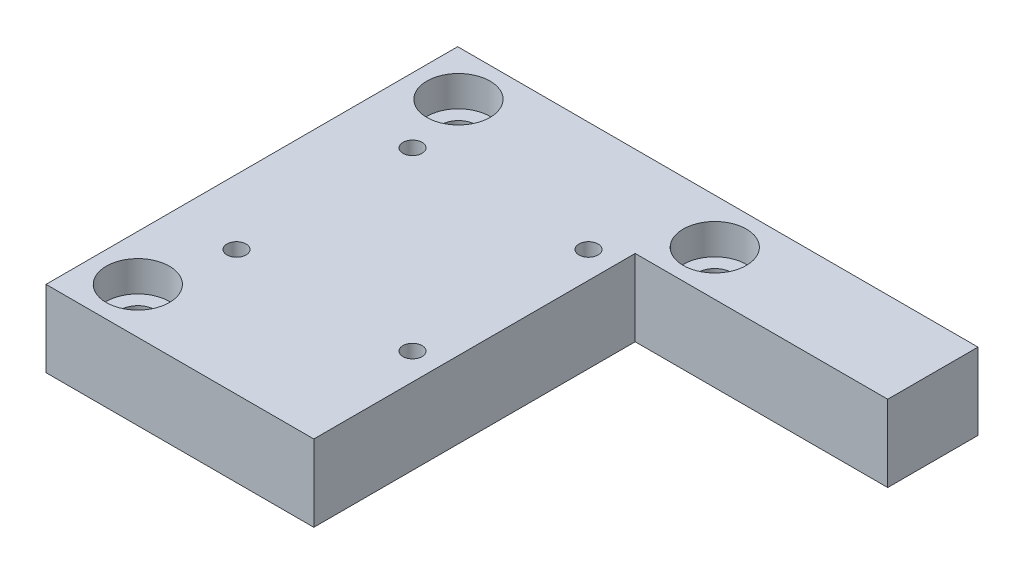
ISO-10303-21;
HEADER;
FILE_DESCRIPTION(('STEP AP214'),'2;1');
FILE_NAME('part.step','',(''),(''),'','','');
FILE_SCHEMA(('AUTOMOTIVE_DESIGN { 1 0 10303 214 1 1 1 1 }'));
ENDSEC;
DATA;
#1=APPLICATION_CONTEXT('core data for automotive mechanical design processes');
#2=APPLICATION_PROTOCOL_DEFINITION('international standard','automotive_design',2000,#1);
#3=PRODUCT_CONTEXT('',#1,'mechanical');
#4=PRODUCT('Part','Part','',(#3));
#5=PRODUCT_RELATED_PRODUCT_CATEGORY('part','',(#4));
#6=PRODUCT_DEFINITION_FORMATION('','',#4);
#7=PRODUCT_DEFINITION_CONTEXT('part definition',#1,'design');
#8=PRODUCT_DEFINITION('design','',#6,#7);
#9=PRODUCT_DEFINITION_SHAPE('','',#8);
#10=(LENGTH_UNIT() NAMED_UNIT(*) SI_UNIT(.MILLI.,.METRE.));
#11=(NAMED_UNIT(*) PLANE_ANGLE_UNIT() SI_UNIT($,.RADIAN.));
#12=(NAMED_UNIT(*) SI_UNIT($,.STERADIAN.) SOLID_ANGLE_UNIT());
#13=UNCERTAINTY_MEASURE_WITH_UNIT(LENGTH_MEASURE(1.E-05),#10,'distance_accuracy_value','');
#14=(GEOMETRIC_REPRESENTATION_CONTEXT(3) GLOBAL_UNCERTAINTY_ASSIGNED_CONTEXT((#13)) GLOBAL_UNIT_ASSIGNED_CONTEXT((#10,
#11,#12)) REPRESENTATION_CONTEXT('',''));
#15=CARTESIAN_POINT('',(0.,0.,0.));
#16=DIRECTION('',(0.,0.,1.));
#17=DIRECTION('',(1.,0.,0.));
#18=AXIS2_PLACEMENT_3D('',#15,#16,#17);
#19=CARTESIAN_POINT('',(68.,-10.,0.));
#20=DIRECTION('',(0.,0.,-1.));
#21=DIRECTION('',(-1.,0.,0.));
#22=AXIS2_PLACEMENT_3D('',#19,#20,#21);
#23=PLANE('',#22);
#24=DIRECTION('',(-1.,0.,0.));
#25=VECTOR('',#24,1.);
#26=CARTESIAN_POINT('',(68.,0.,0.));
#27=LINE('',#26,#25);
#28=CARTESIAN_POINT('',(68.,0.,0.));
#29=VERTEX_POINT('',#28);
#30=CARTESIAN_POINT('',(0.,0.,0.));
#31=VERTEX_POINT('',#30);
#32=EDGE_CURVE('E119',#29,#31,#27,.T.);
#33=ORIENTED_EDGE('',*,*,#32,.F.);
#34=DIRECTION('',(0.,1.,0.));
#35=VECTOR('',#34,1.);
#36=CARTESIAN_POINT('',(68.,-10.,0.));
#37=LINE('',#36,#35);
#38=CARTESIAN_POINT('',(68.,-10.,0.));
#39=VERTEX_POINT('',#38);
#40=EDGE_CURVE('E11',#39,#29,#37,.T.);
#41=ORIENTED_EDGE('',*,*,#40,.F.);
#42=DIRECTION('',(-1.,0.,0.));
#43=VECTOR('',#42,1.);
#44=CARTESIAN_POINT('',(68.,-10.,0.));
#45=LINE('',#44,#43);
#46=CARTESIAN_POINT('',(0.,-10.,0.));
#47=VERTEX_POINT('',#46);
#48=EDGE_CURVE('E117',#39,#47,#45,.T.);
#49=ORIENTED_EDGE('',*,*,#48,.T.);
#50=DIRECTION('',(0.,1.,0.));
#51=VECTOR('',#50,1.);
#52=CARTESIAN_POINT('',(0.,-10.,0.));
#53=LINE('',#52,#51);
#54=EDGE_CURVE('E36',#47,#31,#53,.T.);
#55=ORIENTED_EDGE('',*,*,#54,.T.);
#56=EDGE_LOOP('',(#33,#41,#49,#55));
#57=FACE_BOUND('',#56,.T.);
#58=ADVANCED_FACE('F33',(#57),#23,.T.);
#59=CARTESIAN_POINT('',(68.,-10.,53.8));
#60=DIRECTION('',(1.,0.,0.));
#61=DIRECTION('',(0.,0.,-1.));
#62=AXIS2_PLACEMENT_3D('',#59,#60,#61);
#63=PLANE('',#62);
#64=DIRECTION('',(0.,-1.,0.));
#65=VECTOR('',#64,1.);
#66=CARTESIAN_POINT('',(68.,0.,11.8));
#67=LINE('',#66,#65);
#68=CARTESIAN_POINT('',(68.,0.,11.8));
#69=VERTEX_POINT('',#68);
#70=CARTESIAN_POINT('',(68.,-10.,11.8));
#71=VERTEX_POINT('',#70);
#72=EDGE_CURVE('E129',#69,#71,#67,.T.);
#73=ORIENTED_EDGE('',*,*,#72,.T.);
#74=DIRECTION('',(0.,0.,-1.));
#75=VECTOR('',#74,1.);
#76=CARTESIAN_POINT('',(68.,-10.,53.8));
#77=LINE('',#76,#75);
#78=EDGE_CURVE('E57',#71,#39,#77,.T.);
#79=ORIENTED_EDGE('',*,*,#78,.T.);
#80=ORIENTED_EDGE('',*,*,#40,.T.);
#81=DIRECTION('',(0.,0.,-1.));
#82=VECTOR('',#81,1.);
#83=CARTESIAN_POINT('',(68.,0.,53.8));
#84=LINE('',#83,#82);
#85=EDGE_CURVE('E75',#69,#29,#84,.T.);
#86=ORIENTED_EDGE('',*,*,#85,.F.);
#87=EDGE_LOOP('',(#73,#79,#80,#86));
#88=FACE_BOUND('',#87,.T.);
#89=ADVANCED_FACE('F139',(#88),#63,.T.);
#90=CARTESIAN_POINT('',(0.,-10.,53.8));
#91=DIRECTION('',(0.,0.,1.));
#92=DIRECTION('',(1.,0.,0.));
#93=AXIS2_PLACEMENT_3D('',#90,#91,#92);
#94=PLANE('',#93);
#95=DIRECTION('',(0.,-1.,0.));
#96=VECTOR('',#95,1.);
#97=CARTESIAN_POINT('',(35.,0.,53.8));
#98=LINE('',#97,#96);
#99=CARTESIAN_POINT('',(35.,0.,53.8));
#100=VERTEX_POINT('',#99);
#101=CARTESIAN_POINT('',(35.,-10.,53.8));
#102=VERTEX_POINT('',#101);
#103=EDGE_CURVE('E99',#100,#102,#98,.T.);
#104=ORIENTED_EDGE('',*,*,#103,.F.);
#105=DIRECTION('',(1.,0.,0.));
#106=VECTOR('',#105,1.);
#107=CARTESIAN_POINT('',(0.,0.,53.8));
#108=LINE('',#107,#106);
#109=CARTESIAN_POINT('',(0.,0.,53.8));
#110=VERTEX_POINT('',#109);
#111=EDGE_CURVE('E109',#110,#100,#108,.T.);
#112=ORIENTED_EDGE('',*,*,#111,.F.);
#113=DIRECTION('',(0.,1.,0.));
#114=VECTOR('',#113,1.);
#115=CARTESIAN_POINT('',(0.,-10.,53.8));
#116=LINE('',#115,#114);
#117=CARTESIAN_POINT('',(0.,-10.,53.8));
#118=VERTEX_POINT('',#117);
#119=EDGE_CURVE('E41',#118,#110,#116,.T.);
#120=ORIENTED_EDGE('',*,*,#119,.F.);
#121=DIRECTION('',(1.,0.,0.));
#122=VECTOR('',#121,1.);
#123=CARTESIAN_POINT('',(0.,-10.,53.8));
#124=LINE('',#123,#122);
#125=EDGE_CURVE('E112',#118,#102,#124,.T.);
#126=ORIENTED_EDGE('',*,*,#125,.T.);
#127=EDGE_LOOP('',(#104,#112,#120,#126));
#128=FACE_BOUND('',#127,.T.);
#129=ADVANCED_FACE('F108',(#128),#94,.T.);
#130=CARTESIAN_POINT('',(0.,-10.,0.));
#131=DIRECTION('',(-1.,0.,0.));
#132=DIRECTION('',(0.,0.,1.));
#133=AXIS2_PLACEMENT_3D('',#130,#131,#132);
#134=PLANE('',#133);
#135=DIRECTION('',(0.,0.,1.));
#136=VECTOR('',#135,1.);
#137=CARTESIAN_POINT('',(0.,0.,0.));
#138=LINE('',#137,#136);
#139=EDGE_CURVE('E115',#31,#110,#138,.T.);
#140=ORIENTED_EDGE('',*,*,#139,.F.);
#141=ORIENTED_EDGE('',*,*,#54,.F.);
#142=DIRECTION('',(0.,0.,1.));
#143=VECTOR('',#142,1.);
#144=CARTESIAN_POINT('',(0.,-10.,0.));
#145=LINE('',#144,#143);
#146=EDGE_CURVE('E126',#47,#118,#145,.T.);
#147=ORIENTED_EDGE('',*,*,#146,.T.);
#148=ORIENTED_EDGE('',*,*,#119,.T.);
#149=EDGE_LOOP('',(#140,#141,#147,#148));
#150=FACE_BOUND('',#149,.T.);
#151=ADVANCED_FACE('F135',(#150),#134,.T.);
#152=CARTESIAN_POINT('',(0.,-10.,0.));
#153=DIRECTION('',(0.,1.,0.));
#154=DIRECTION('',(0.,0.,1.));
#155=AXIS2_PLACEMENT_3D('',#152,#153,#154);
#156=PLANE('',#155);
#157=CARTESIAN_POINT('',(6.,-10.,47.8));
#158=DIRECTION('',(0.,1.,0.));
#159=DIRECTION('',(0.,0.,1.));
#160=AXIS2_PLACEMENT_3D('',#157,#158,#159);
#161=CIRCLE('',#160,2.25000000000002);
#162=CARTESIAN_POINT('',(6.,-10.,50.05));
#163=VERTEX_POINT('',#162);
#164=EDGE_CURVE('E232',#163,#163,#161,.T.);
#165=ORIENTED_EDGE('',*,*,#164,.T.);
#166=EDGE_LOOP('',(#165));
#167=FACE_BOUND('',#166,.T.);
#168=CARTESIAN_POINT('',(6.,-10.,5.90000000000001));
#169=DIRECTION('',(0.,1.,0.));
#170=DIRECTION('',(0.,0.,1.));
#171=AXIS2_PLACEMENT_3D('',#168,#169,#170);
#172=CIRCLE('',#171,2.25000000000002);
#173=CARTESIAN_POINT('',(6.,-10.,8.15000000000003));
#174=VERTEX_POINT('',#173);
#175=EDGE_CURVE('E243',#174,#174,#172,.T.);
#176=ORIENTED_EDGE('',*,*,#175,.T.);
#177=EDGE_LOOP('',(#176));
#178=FACE_BOUND('',#177,.T.);
#179=CARTESIAN_POINT('',(39.5,-10.,5.9));
#180=DIRECTION('',(0.,1.,0.));
#181=DIRECTION('',(0.,0.,1.));
#182=AXIS2_PLACEMENT_3D('',#179,#180,#181);
#183=CIRCLE('',#182,2.25000000000002);
#184=CARTESIAN_POINT('',(39.5,-10.,8.15000000000002));
#185=VERTEX_POINT('',#184);
#186=EDGE_CURVE('E255',#185,#185,#183,.T.);
#187=ORIENTED_EDGE('',*,*,#186,.T.);
#188=EDGE_LOOP('',(#187));
#189=FACE_BOUND('',#188,.T.);
#190=CARTESIAN_POINT('',(31.5021834883644,-10.,14.402424999977));
#191=DIRECTION('',(0.,-1.,0.));
#192=DIRECTION('',(0.,0.,-1.));
#193=AXIS2_PLACEMENT_3D('',#190,#191,#192);
#194=CIRCLE('',#193,1.24999999999369);
#195=CARTESIAN_POINT('',(31.5021834883644,-10.,13.1524249999833));
#196=VERTEX_POINT('',#195);
#197=EDGE_CURVE('E258',#196,#196,#194,.T.);
#198=ORIENTED_EDGE('',*,*,#197,.F.);
#199=EDGE_LOOP('',(#198));
#200=FACE_BOUND('',#199,.T.);
#201=CARTESIAN_POINT('',(31.5000000000003,-10.,37.4046084883411));
#202=DIRECTION('',(0.,-1.,0.));
#203=DIRECTION('',(0.,0.,-1.));
#204=AXIS2_PLACEMENT_3D('',#201,#202,#203);
#205=CIRCLE('',#204,1.24999999999369);
#206=CARTESIAN_POINT('',(31.5000000000003,-10.,36.1546084883474));
#207=VERTEX_POINT('',#206);
#208=EDGE_CURVE('E264',#207,#207,#205,.T.);
#209=ORIENTED_EDGE('',*,*,#208,.F.);
#210=EDGE_LOOP('',(#209));
#211=FACE_BOUND('',#210,.T.);
#212=CARTESIAN_POINT('',(8.497816511636,-10.,37.4024249999771));
#213=DIRECTION('',(0.,-1.,0.));
#214=DIRECTION('',(0.,0.,-1.));
#215=AXIS2_PLACEMENT_3D('',#212,#213,#214);
#216=CIRCLE('',#215,1.24999999999369);
#217=CARTESIAN_POINT('',(8.497816511636,-10.,36.1524249999834));
#218=VERTEX_POINT('',#217);
#219=EDGE_CURVE('E270',#218,#218,#216,.T.);
#220=ORIENTED_EDGE('',*,*,#219,.F.);
#221=EDGE_LOOP('',(#220));
#222=FACE_BOUND('',#221,.T.);
#223=CARTESIAN_POINT('',(8.50000000000008,-10.,14.4002415116128));
#224=DIRECTION('',(0.,-1.,0.));
#225=DIRECTION('',(0.,0.,-1.));
#226=AXIS2_PLACEMENT_3D('',#223,#224,#225);
#227=CIRCLE('',#226,1.24999999999369);
#228=CARTESIAN_POINT('',(8.50000000000008,-10.,13.1502415116191));
#229=VERTEX_POINT('',#228);
#230=EDGE_CURVE('E276',#229,#229,#227,.T.);
#231=ORIENTED_EDGE('',*,*,#230,.F.);
#232=EDGE_LOOP('',(#231));
#233=FACE_BOUND('',#232,.T.);
#234=ORIENTED_EDGE('',*,*,#78,.F.);
#235=DIRECTION('',(1.,0.,0.));
#236=VECTOR('',#235,1.);
#237=CARTESIAN_POINT('',(35.,-10.,11.8));
#238=LINE('',#237,#236);
#239=CARTESIAN_POINT('',(35.,-10.,11.8));
#240=VERTEX_POINT('',#239);
#241=EDGE_CURVE('E103',#240,#71,#238,.T.);
#242=ORIENTED_EDGE('',*,*,#241,.F.);
#243=DIRECTION('',(0.,0.,-1.));
#244=VECTOR('',#243,1.);
#245=CARTESIAN_POINT('',(35.,-10.,53.8));
#246=LINE('',#245,#244);
#247=EDGE_CURVE('E281',#102,#240,#246,.T.);
#248=ORIENTED_EDGE('',*,*,#247,.F.);
#249=ORIENTED_EDGE('',*,*,#125,.F.);
#250=ORIENTED_EDGE('',*,*,#146,.F.);
#251=ORIENTED_EDGE('',*,*,#48,.F.);
#252=EDGE_LOOP('',(#234,#242,#248,#249,#250,#251));
#253=FACE_BOUND('',#252,.T.);
#254=ADVANCED_FACE('F138',(#167,#178,#189,#200,#211,#222,#233,#253),#156,.F.);
#255=CARTESIAN_POINT('',(0.,0.,0.));
#256=DIRECTION('',(0.,1.,0.));
#257=DIRECTION('',(0.,0.,1.));
#258=AXIS2_PLACEMENT_3D('',#255,#256,#257);
#259=PLANE('',#258);
#260=CARTESIAN_POINT('',(6.,0.,47.8));
#261=DIRECTION('',(0.,1.,0.));
#262=DIRECTION('',(0.,0.,1.));
#263=AXIS2_PLACEMENT_3D('',#260,#261,#262);
#264=CIRCLE('',#263,4.125);
#265=CARTESIAN_POINT('',(6.,0.,51.925));
#266=VERTEX_POINT('',#265);
#267=EDGE_CURVE('E225',#266,#266,#264,.T.);
#268=ORIENTED_EDGE('',*,*,#267,.F.);
#269=EDGE_LOOP('',(#268));
#270=FACE_BOUND('',#269,.T.);
#271=CARTESIAN_POINT('',(6.,0.,5.90000000000001));
#272=DIRECTION('',(0.,1.,0.));
#273=DIRECTION('',(0.,0.,1.));
#274=AXIS2_PLACEMENT_3D('',#271,#272,#273);
#275=CIRCLE('',#274,4.125);
#276=CARTESIAN_POINT('',(6.,0.,10.025));
#277=VERTEX_POINT('',#276);
#278=EDGE_CURVE('E234',#277,#277,#275,.T.);
#279=ORIENTED_EDGE('',*,*,#278,.F.);
#280=EDGE_LOOP('',(#279));
#281=FACE_BOUND('',#280,.T.);
#282=CARTESIAN_POINT('',(39.5,0.,5.9));
#283=DIRECTION('',(0.,1.,0.));
#284=DIRECTION('',(0.,0.,1.));
#285=AXIS2_PLACEMENT_3D('',#282,#283,#284);
#286=CIRCLE('',#285,4.125);
#287=CARTESIAN_POINT('',(39.5,0.,10.025));
#288=VERTEX_POINT('',#287);
#289=EDGE_CURVE('E246',#288,#288,#286,.T.);
#290=ORIENTED_EDGE('',*,*,#289,.F.);
#291=EDGE_LOOP('',(#290));
#292=FACE_BOUND('',#291,.T.);
#293=CARTESIAN_POINT('',(31.5021834883644,0.,14.402424999977));
#294=DIRECTION('',(0.,-1.,0.));
#295=DIRECTION('',(0.,0.,-1.));
#296=AXIS2_PLACEMENT_3D('',#293,#294,#295);
#297=CIRCLE('',#296,1.24999999999369);
#298=CARTESIAN_POINT('',(31.5021834883644,0.,13.1524249999833));
#299=VERTEX_POINT('',#298);
#300=EDGE_CURVE('E261',#299,#299,#297,.T.);
#301=ORIENTED_EDGE('',*,*,#300,.T.);
#302=EDGE_LOOP('',(#301));
#303=FACE_BOUND('',#302,.T.);
#304=CARTESIAN_POINT('',(31.5000000000003,0.,37.4046084883411));
#305=DIRECTION('',(0.,-1.,0.));
#306=DIRECTION('',(0.,0.,-1.));
#307=AXIS2_PLACEMENT_3D('',#304,#305,#306);
#308=CIRCLE('',#307,1.24999999999369);
#309=CARTESIAN_POINT('',(31.5000000000003,0.,36.1546084883474));
#310=VERTEX_POINT('',#309);
#311=EDGE_CURVE('E267',#310,#310,#308,.T.);
#312=ORIENTED_EDGE('',*,*,#311,.T.);
#313=EDGE_LOOP('',(#312));
#314=FACE_BOUND('',#313,.T.);
#315=CARTESIAN_POINT('',(8.497816511636,0.,37.4024249999771));
#316=DIRECTION('',(0.,-1.,0.));
#317=DIRECTION('',(0.,0.,-1.));
#318=AXIS2_PLACEMENT_3D('',#315,#316,#317);
#319=CIRCLE('',#318,1.24999999999369);
#320=CARTESIAN_POINT('',(8.497816511636,0.,36.1524249999834));
#321=VERTEX_POINT('',#320);
#322=EDGE_CURVE('E273',#321,#321,#319,.T.);
#323=ORIENTED_EDGE('',*,*,#322,.T.);
#324=EDGE_LOOP('',(#323));
#325=FACE_BOUND('',#324,.T.);
#326=CARTESIAN_POINT('',(8.50000000000008,0.,14.4002415116128));
#327=DIRECTION('',(0.,-1.,0.));
#328=DIRECTION('',(0.,0.,-1.));
#329=AXIS2_PLACEMENT_3D('',#326,#327,#328);
#330=CIRCLE('',#329,1.24999999999369);
#331=CARTESIAN_POINT('',(8.50000000000008,0.,13.1502415116191));
#332=VERTEX_POINT('',#331);
#333=EDGE_CURVE('E279',#332,#332,#330,.T.);
#334=ORIENTED_EDGE('',*,*,#333,.T.);
#335=EDGE_LOOP('',(#334));
#336=FACE_BOUND('',#335,.T.);
#337=DIRECTION('',(1.,0.,0.));
#338=VECTOR('',#337,1.);
#339=CARTESIAN_POINT('',(35.,0.,11.8));
#340=LINE('',#339,#338);
#341=CARTESIAN_POINT('',(35.,0.,11.8));
#342=VERTEX_POINT('',#341);
#343=EDGE_CURVE('E49',#342,#69,#340,.T.);
#344=ORIENTED_EDGE('',*,*,#343,.T.);
#345=ORIENTED_EDGE('',*,*,#85,.T.);
#346=ORIENTED_EDGE('',*,*,#32,.T.);
#347=ORIENTED_EDGE('',*,*,#139,.T.);
#348=ORIENTED_EDGE('',*,*,#111,.T.);
#349=DIRECTION('',(0.,0.,-1.));
#350=VECTOR('',#349,1.);
#351=CARTESIAN_POINT('',(35.,0.,53.8));
#352=LINE('',#351,#350);
#353=EDGE_CURVE('E95',#100,#342,#352,.T.);
#354=ORIENTED_EDGE('',*,*,#353,.T.);
#355=EDGE_LOOP('',(#344,#345,#346,#347,#348,#354));
#356=FACE_BOUND('',#355,.T.);
#357=ADVANCED_FACE('F114',(#270,#281,#292,#303,#314,#325,#336,#356),#259,.T.);
#358=CARTESIAN_POINT('',(35.,0.,11.8));
#359=DIRECTION('',(0.,0.,-1.));
#360=DIRECTION('',(-1.,0.,0.));
#361=AXIS2_PLACEMENT_3D('',#358,#359,#360);
#362=PLANE('',#361);
#363=ORIENTED_EDGE('',*,*,#241,.T.);
#364=ORIENTED_EDGE('',*,*,#72,.F.);
#365=ORIENTED_EDGE('',*,*,#343,.F.);
#366=DIRECTION('',(0.,-1.,0.));
#367=VECTOR('',#366,1.);
#368=CARTESIAN_POINT('',(35.,0.,11.8));
#369=LINE('',#368,#367);
#370=EDGE_CURVE('E101',#342,#240,#369,.T.);
#371=ORIENTED_EDGE('',*,*,#370,.T.);
#372=EDGE_LOOP('',(#363,#364,#365,#371));
#373=FACE_BOUND('',#372,.T.);
#374=ADVANCED_FACE('F157',(#373),#362,.F.);
#375=CARTESIAN_POINT('',(35.,0.,53.8));
#376=DIRECTION('',(-1.,0.,0.));
#377=DIRECTION('',(0.,0.,1.));
#378=AXIS2_PLACEMENT_3D('',#375,#376,#377);
#379=PLANE('',#378);
#380=ORIENTED_EDGE('',*,*,#247,.T.);
#381=ORIENTED_EDGE('',*,*,#370,.F.);
#382=ORIENTED_EDGE('',*,*,#353,.F.);
#383=ORIENTED_EDGE('',*,*,#103,.T.);
#384=EDGE_LOOP('',(#380,#381,#382,#383));
#385=FACE_BOUND('',#384,.T.);
#386=ADVANCED_FACE('F98',(#385),#379,.F.);
#387=CARTESIAN_POINT('',(8.50000000000008,-10.,14.4002415116128));
#388=DIRECTION('',(0.,-1.,0.));
#389=DIRECTION('',(0.,0.,-1.));
#390=AXIS2_PLACEMENT_3D('',#387,#388,#389);
#391=CYLINDRICAL_SURFACE('',#390,1.24999999999369);
#392=ORIENTED_EDGE('',*,*,#333,.F.);
#393=EDGE_LOOP('',(#392));
#394=FACE_BOUND('',#393,.T.);
#395=ORIENTED_EDGE('',*,*,#230,.T.);
#396=EDGE_LOOP('',(#395));
#397=FACE_BOUND('',#396,.T.);
#398=ADVANCED_FACE('F164',(#394,#397),#391,.F.);
#399=CARTESIAN_POINT('',(8.497816511636,-10.,37.4024249999771));
#400=DIRECTION('',(0.,-1.,0.));
#401=DIRECTION('',(0.,0.,-1.));
#402=AXIS2_PLACEMENT_3D('',#399,#400,#401);
#403=CYLINDRICAL_SURFACE('',#402,1.24999999999369);
#404=ORIENTED_EDGE('',*,*,#322,.F.);
#405=EDGE_LOOP('',(#404));
#406=FACE_BOUND('',#405,.T.);
#407=ORIENTED_EDGE('',*,*,#219,.T.);
#408=EDGE_LOOP('',(#407));
#409=FACE_BOUND('',#408,.T.);
#410=ADVANCED_FACE('F169',(#406,#409),#403,.F.);
#411=CARTESIAN_POINT('',(31.5000000000003,-10.,37.4046084883411));
#412=DIRECTION('',(0.,-1.,0.));
#413=DIRECTION('',(0.,0.,-1.));
#414=AXIS2_PLACEMENT_3D('',#411,#412,#413);
#415=CYLINDRICAL_SURFACE('',#414,1.24999999999369);
#416=ORIENTED_EDGE('',*,*,#311,.F.);
#417=EDGE_LOOP('',(#416));
#418=FACE_BOUND('',#417,.T.);
#419=ORIENTED_EDGE('',*,*,#208,.T.);
#420=EDGE_LOOP('',(#419));
#421=FACE_BOUND('',#420,.T.);
#422=ADVANCED_FACE('F173',(#418,#421),#415,.F.);
#423=CARTESIAN_POINT('',(31.5021834883644,-10.,14.402424999977));
#424=DIRECTION('',(0.,-1.,0.));
#425=DIRECTION('',(0.,0.,-1.));
#426=AXIS2_PLACEMENT_3D('',#423,#424,#425);
#427=CYLINDRICAL_SURFACE('',#426,1.24999999999369);
#428=ORIENTED_EDGE('',*,*,#300,.F.);
#429=EDGE_LOOP('',(#428));
#430=FACE_BOUND('',#429,.T.);
#431=ORIENTED_EDGE('',*,*,#197,.T.);
#432=EDGE_LOOP('',(#431));
#433=FACE_BOUND('',#432,.T.);
#434=ADVANCED_FACE('F177',(#430,#433),#427,.F.);
#435=CARTESIAN_POINT('',(39.5,0.,5.9));
#436=DIRECTION('',(0.,1.,0.));
#437=DIRECTION('',(0.,0.,1.));
#438=AXIS2_PLACEMENT_3D('',#435,#436,#437);
#439=CYLINDRICAL_SURFACE('',#438,2.25000000000002);
#440=ORIENTED_EDGE('',*,*,#186,.F.);
#441=EDGE_LOOP('',(#440));
#442=FACE_BOUND('',#441,.T.);
#443=CARTESIAN_POINT('',(39.5,-4.,5.9));
#444=DIRECTION('',(0.,1.,0.));
#445=DIRECTION('',(0.,0.,1.));
#446=AXIS2_PLACEMENT_3D('',#443,#444,#445);
#447=CIRCLE('',#446,2.25000000000002);
#448=CARTESIAN_POINT('',(39.5,-4.,8.15000000000003));
#449=VERTEX_POINT('',#448);
#450=EDGE_CURVE('E252',#449,#449,#447,.T.);
#451=ORIENTED_EDGE('',*,*,#450,.T.);
#452=EDGE_LOOP('',(#451));
#453=FACE_BOUND('',#452,.T.);
#454=ADVANCED_FACE('F181',(#442,#453),#439,.F.);
#455=CARTESIAN_POINT('',(41.75,-4.,5.9));
#456=DIRECTION('',(0.,-1.,0.));
#457=DIRECTION('',(0.,0.,-1.));
#458=AXIS2_PLACEMENT_3D('',#455,#456,#457);
#459=PLANE('',#458);
#460=ORIENTED_EDGE('',*,*,#450,.F.);
#461=EDGE_LOOP('',(#460));
#462=FACE_BOUND('',#461,.T.);
#463=CARTESIAN_POINT('',(39.5,-4.,5.9));
#464=DIRECTION('',(0.,1.,0.));
#465=DIRECTION('',(0.,0.,1.));
#466=AXIS2_PLACEMENT_3D('',#463,#464,#465);
#467=CIRCLE('',#466,4.125);
#468=CARTESIAN_POINT('',(39.5,-4.,10.025));
#469=VERTEX_POINT('',#468);
#470=EDGE_CURVE('E249',#469,#469,#467,.T.);
#471=ORIENTED_EDGE('',*,*,#470,.T.);
#472=EDGE_LOOP('',(#471));
#473=FACE_BOUND('',#472,.T.);
#474=ADVANCED_FACE('F185',(#462,#473),#459,.F.);
#475=CARTESIAN_POINT('',(39.5,0.,5.9));
#476=DIRECTION('',(0.,1.,0.));
#477=DIRECTION('',(0.,0.,1.));
#478=AXIS2_PLACEMENT_3D('',#475,#476,#477);
#479=CYLINDRICAL_SURFACE('',#478,4.125);
#480=ORIENTED_EDGE('',*,*,#470,.F.);
#481=EDGE_LOOP('',(#480));
#482=FACE_BOUND('',#481,.T.);
#483=ORIENTED_EDGE('',*,*,#289,.T.);
#484=EDGE_LOOP('',(#483));
#485=FACE_BOUND('',#484,.T.);
#486=ADVANCED_FACE('F189',(#482,#485),#479,.F.);
#487=CARTESIAN_POINT('',(6.,0.,5.90000000000001));
#488=DIRECTION('',(0.,1.,0.));
#489=DIRECTION('',(0.,0.,1.));
#490=AXIS2_PLACEMENT_3D('',#487,#488,#489);
#491=CYLINDRICAL_SURFACE('',#490,2.25000000000002);
#492=ORIENTED_EDGE('',*,*,#175,.F.);
#493=EDGE_LOOP('',(#492));
#494=FACE_BOUND('',#493,.T.);
#495=CARTESIAN_POINT('',(6.,-4.,5.90000000000001));
#496=DIRECTION('',(0.,1.,0.));
#497=DIRECTION('',(0.,0.,1.));
#498=AXIS2_PLACEMENT_3D('',#495,#496,#497);
#499=CIRCLE('',#498,2.25000000000002);
#500=CARTESIAN_POINT('',(6.,-4.,8.15000000000003));
#501=VERTEX_POINT('',#500);
#502=EDGE_CURVE('E240',#501,#501,#499,.T.);
#503=ORIENTED_EDGE('',*,*,#502,.T.);
#504=EDGE_LOOP('',(#503));
#505=FACE_BOUND('',#504,.T.);
#506=ADVANCED_FACE('F193',(#494,#505),#491,.F.);
#507=CARTESIAN_POINT('',(8.25000000000002,-4.,5.90000000000001));
#508=DIRECTION('',(0.,-1.,0.));
#509=DIRECTION('',(0.,0.,-1.));
#510=AXIS2_PLACEMENT_3D('',#507,#508,#509);
#511=PLANE('',#510);
#512=ORIENTED_EDGE('',*,*,#502,.F.);
#513=EDGE_LOOP('',(#512));
#514=FACE_BOUND('',#513,.T.);
#515=CARTESIAN_POINT('',(6.,-4.,5.90000000000001));
#516=DIRECTION('',(0.,1.,0.));
#517=DIRECTION('',(0.,0.,1.));
#518=AXIS2_PLACEMENT_3D('',#515,#516,#517);
#519=CIRCLE('',#518,4.125);
#520=CARTESIAN_POINT('',(6.,-4.,10.025));
#521=VERTEX_POINT('',#520);
#522=EDGE_CURVE('E237',#521,#521,#519,.T.);
#523=ORIENTED_EDGE('',*,*,#522,.T.);
#524=EDGE_LOOP('',(#523));
#525=FACE_BOUND('',#524,.T.);
#526=ADVANCED_FACE('F197',(#514,#525),#511,.F.);
#527=CARTESIAN_POINT('',(6.,0.,5.90000000000001));
#528=DIRECTION('',(0.,1.,0.));
#529=DIRECTION('',(0.,0.,1.));
#530=AXIS2_PLACEMENT_3D('',#527,#528,#529);
#531=CYLINDRICAL_SURFACE('',#530,4.125);
#532=ORIENTED_EDGE('',*,*,#522,.F.);
#533=EDGE_LOOP('',(#532));
#534=FACE_BOUND('',#533,.T.);
#535=ORIENTED_EDGE('',*,*,#278,.T.);
#536=EDGE_LOOP('',(#535));
#537=FACE_BOUND('',#536,.T.);
#538=ADVANCED_FACE('F201',(#534,#537),#531,.F.);
#539=CARTESIAN_POINT('',(6.,0.,47.8));
#540=DIRECTION('',(0.,1.,0.));
#541=DIRECTION('',(0.,0.,1.));
#542=AXIS2_PLACEMENT_3D('',#539,#540,#541);
#543=CYLINDRICAL_SURFACE('',#542,2.25000000000002);
#544=ORIENTED_EDGE('',*,*,#164,.F.);
#545=EDGE_LOOP('',(#544));
#546=FACE_BOUND('',#545,.T.);
#547=CARTESIAN_POINT('',(6.,-4.,47.8));
#548=DIRECTION('',(0.,1.,0.));
#549=DIRECTION('',(0.,0.,1.));
#550=AXIS2_PLACEMENT_3D('',#547,#548,#549);
#551=CIRCLE('',#550,2.25000000000002);
#552=CARTESIAN_POINT('',(6.,-4.,50.05));
#553=VERTEX_POINT('',#552);
#554=EDGE_CURVE('E227',#553,#553,#551,.T.);
#555=ORIENTED_EDGE('',*,*,#554,.T.);
#556=EDGE_LOOP('',(#555));
#557=FACE_BOUND('',#556,.T.);
#558=ADVANCED_FACE('F205',(#546,#557),#543,.F.);
#559=CARTESIAN_POINT('',(8.25000000000002,-4.,47.8));
#560=DIRECTION('',(0.,-1.,0.));
#561=DIRECTION('',(0.,0.,-1.));
#562=AXIS2_PLACEMENT_3D('',#559,#560,#561);
#563=PLANE('',#562);
#564=ORIENTED_EDGE('',*,*,#554,.F.);
#565=EDGE_LOOP('',(#564));
#566=FACE_BOUND('',#565,.T.);
#567=CARTESIAN_POINT('',(6.,-4.,47.8));
#568=DIRECTION('',(0.,1.,0.));
#569=DIRECTION('',(0.,0.,1.));
#570=AXIS2_PLACEMENT_3D('',#567,#568,#569);
#571=CIRCLE('',#570,4.125);
#572=CARTESIAN_POINT('',(6.,-4.,51.925));
#573=VERTEX_POINT('',#572);
#574=EDGE_CURVE('E222',#573,#573,#571,.T.);
#575=ORIENTED_EDGE('',*,*,#574,.T.);
#576=EDGE_LOOP('',(#575));
#577=FACE_BOUND('',#576,.T.);
#578=ADVANCED_FACE('F209',(#566,#577),#563,.F.);
#579=CARTESIAN_POINT('',(6.,0.,47.8));
#580=DIRECTION('',(0.,1.,0.));
#581=DIRECTION('',(0.,0.,1.));
#582=AXIS2_PLACEMENT_3D('',#579,#580,#581);
#583=CYLINDRICAL_SURFACE('',#582,4.125);
#584=ORIENTED_EDGE('',*,*,#574,.F.);
#585=EDGE_LOOP('',(#584));
#586=FACE_BOUND('',#585,.T.);
#587=ORIENTED_EDGE('',*,*,#267,.T.);
#588=EDGE_LOOP('',(#587));
#589=FACE_BOUND('',#588,.T.);
#590=ADVANCED_FACE('F213',(#586,#589),#583,.F.);
#591=CLOSED_SHELL('',(#58,#89,#129,#151,#254,#357,#374,#386,#398,#410,#422,#434,#454,#474,#486,
#506,#526,#538,#558,#578,#590));
#592=MANIFOLD_SOLID_BREP('B2',#591);
#593=ADVANCED_BREP_SHAPE_REPRESENTATION('',(#18,#592),#14);
#594=SHAPE_DEFINITION_REPRESENTATION(#9,#593);
ENDSEC;
END-ISO-10303-21;
